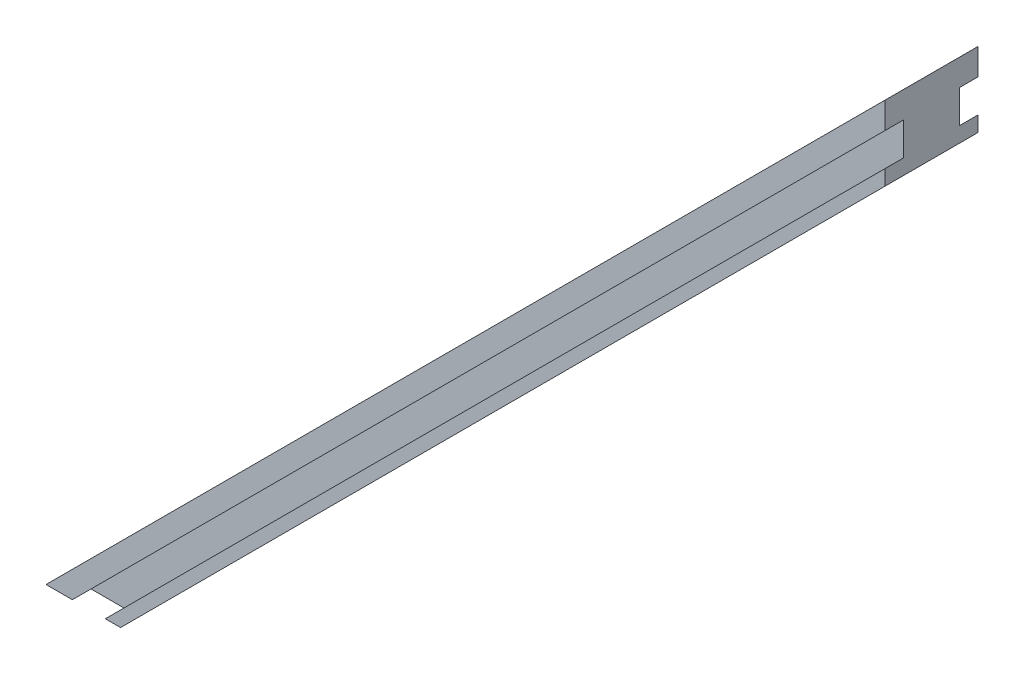
ISO-10303-21;
HEADER;
FILE_DESCRIPTION(('STEP AP214'),'2;1');
FILE_NAME('part.step','',(''),(''),'','','');
FILE_SCHEMA(('AUTOMOTIVE_DESIGN { 1 0 10303 214 1 1 1 1 }'));
ENDSEC;
DATA;
#1=APPLICATION_CONTEXT('core data for automotive mechanical design processes');
#2=APPLICATION_PROTOCOL_DEFINITION('international standard','automotive_design',2000,#1);
#3=PRODUCT_CONTEXT('',#1,'mechanical');
#4=PRODUCT('Part','Part','',(#3));
#5=PRODUCT_RELATED_PRODUCT_CATEGORY('part','',(#4));
#6=PRODUCT_DEFINITION_FORMATION('','',#4);
#7=PRODUCT_DEFINITION_CONTEXT('part definition',#1,'design');
#8=PRODUCT_DEFINITION('design','',#6,#7);
#9=PRODUCT_DEFINITION_SHAPE('','',#8);
#10=(LENGTH_UNIT() NAMED_UNIT(*) SI_UNIT(.MILLI.,.METRE.));
#11=(NAMED_UNIT(*) PLANE_ANGLE_UNIT() SI_UNIT($,.RADIAN.));
#12=(NAMED_UNIT(*) SI_UNIT($,.STERADIAN.) SOLID_ANGLE_UNIT());
#13=UNCERTAINTY_MEASURE_WITH_UNIT(LENGTH_MEASURE(1.E-05),#10,'distance_accuracy_value','');
#14=(GEOMETRIC_REPRESENTATION_CONTEXT(3) GLOBAL_UNCERTAINTY_ASSIGNED_CONTEXT((#13)) GLOBAL_UNIT_ASSIGNED_CONTEXT((#10,
#11,#12)) REPRESENTATION_CONTEXT('',''));
#15=CARTESIAN_POINT('',(0.,0.,0.));
#16=DIRECTION('',(0.,0.,1.));
#17=DIRECTION('',(1.,0.,0.));
#18=AXIS2_PLACEMENT_3D('',#15,#16,#17);
#19=CARTESIAN_POINT('',(-27.8198051533946,-28.7487373415292,0.));
#20=DIRECTION('',(0.707106781186549,-0.707106781186546,0.));
#21=DIRECTION('',(0.707106781186546,0.707106781186549,0.));
#22=AXIS2_PLACEMENT_3D('',#19,#20,#21);
#23=CYLINDRICAL_SURFACE('',#22,1.25);
#24=CARTESIAN_POINT('',(-24.2842712474618,-32.2842712474619,0.));
#25=DIRECTION('',(-0.707106781186549,0.707106781186546,0.));
#26=DIRECTION('',(-0.707106781186546,-0.707106781186549,0.));
#27=AXIS2_PLACEMENT_3D('',#24,#25,#26);
#28=CIRCLE('',#27,1.25);
#29=CARTESIAN_POINT('',(-25.168154723945,-33.1681547239451,0.));
#30=VERTEX_POINT('',#29);
#31=EDGE_CURVE('E269',#30,#30,#28,.T.);
#32=ORIENTED_EDGE('',*,*,#31,.F.);
#33=EDGE_LOOP('',(#32));
#34=FACE_BOUND('',#33,.T.);
#35=CARTESIAN_POINT('',(-27.223611075682,-29.3449314192418,0.));
#36=DIRECTION('',(-0.707106781186549,0.707106781186546,0.));
#37=DIRECTION('',(-0.707106781186546,-0.707106781186549,0.));
#38=AXIS2_PLACEMENT_3D('',#35,#36,#37);
#39=CIRCLE('',#38,1.25);
#40=CARTESIAN_POINT('',(-28.1074945521652,-30.228814895725,0.));
#41=VERTEX_POINT('',#40);
#42=EDGE_CURVE('E38',#41,#41,#39,.T.);
#43=ORIENTED_EDGE('',*,*,#42,.T.);
#44=EDGE_LOOP('',(#43));
#45=FACE_BOUND('',#44,.T.);
#46=ADVANCED_FACE('F34',(#34,#45),#23,.F.);
#47=CARTESIAN_POINT('',(28.7487373415291,27.8198051533947,0.));
#48=DIRECTION('',(0.707106781186549,-0.707106781186546,0.));
#49=DIRECTION('',(0.707106781186546,0.707106781186549,0.));
#50=AXIS2_PLACEMENT_3D('',#47,#48,#49);
#51=CYLINDRICAL_SURFACE('',#50,1.25);
#52=CARTESIAN_POINT('',(32.2842712474618,24.284271247462,0.));
#53=DIRECTION('',(-0.707106781186549,0.707106781186546,0.));
#54=DIRECTION('',(-0.707106781186546,-0.707106781186549,0.));
#55=AXIS2_PLACEMENT_3D('',#52,#53,#54);
#56=CIRCLE('',#55,1.25);
#57=CARTESIAN_POINT('',(31.4003877709786,23.4003877709788,0.));
#58=VERTEX_POINT('',#57);
#59=EDGE_CURVE('E229',#58,#58,#56,.T.);
#60=ORIENTED_EDGE('',*,*,#59,.F.);
#61=EDGE_LOOP('',(#60));
#62=FACE_BOUND('',#61,.T.);
#63=CARTESIAN_POINT('',(29.3449314192417,27.2236110756822,0.));
#64=DIRECTION('',(-0.707106781186549,0.707106781186546,0.));
#65=DIRECTION('',(-0.707106781186546,-0.707106781186549,0.));
#66=AXIS2_PLACEMENT_3D('',#63,#64,#65);
#67=CIRCLE('',#66,1.25);
#68=CARTESIAN_POINT('',(28.4610479427585,26.339727599199,0.));
#69=VERTEX_POINT('',#68);
#70=EDGE_CURVE('E206',#69,#69,#67,.T.);
#71=ORIENTED_EDGE('',*,*,#70,.T.);
#72=EDGE_LOOP('',(#71));
#73=FACE_BOUND('',#72,.T.);
#74=ADVANCED_FACE('F337',(#62,#73),#51,.F.);
#75=CARTESIAN_POINT('',(-44.9999999999998,-45.,5.));
#76=DIRECTION('',(0.,1.,0.));
#77=DIRECTION('',(0.,0.,1.));
#78=AXIS2_PLACEMENT_3D('',#75,#76,#77);
#79=PLANE('',#78);
#80=DIRECTION('',(0.,0.,-1.));
#81=VECTOR('',#80,1.);
#82=CARTESIAN_POINT('',(-42.171572875254,-45.,-3.));
#83=LINE('',#82,#81);
#84=CARTESIAN_POINT('',(-42.171572875254,-45.,-3.));
#85=VERTEX_POINT('',#84);
#86=CARTESIAN_POINT('',(-42.171572875254,-45.,-5.));
#87=VERTEX_POINT('',#86);
#88=EDGE_CURVE('E148',#85,#87,#83,.T.);
#89=ORIENTED_EDGE('',*,*,#88,.F.);
#90=DIRECTION('',(1.,0.,0.));
#91=VECTOR('',#90,1.);
#92=CARTESIAN_POINT('',(-42.171572875254,-45.,-3.));
#93=LINE('',#92,#91);
#94=CARTESIAN_POINT('',(-38.6360389693213,-45.,-3.));
#95=VERTEX_POINT('',#94);
#96=EDGE_CURVE('E131',#85,#95,#93,.T.);
#97=ORIENTED_EDGE('',*,*,#96,.T.);
#98=DIRECTION('',(0.,0.,-1.));
#99=VECTOR('',#98,1.);
#100=CARTESIAN_POINT('',(-38.6360389693213,-45.,-3.));
#101=LINE('',#100,#99);
#102=CARTESIAN_POINT('',(-38.6360389693213,-45.,-5.));
#103=VERTEX_POINT('',#102);
#104=EDGE_CURVE('E127',#95,#103,#101,.T.);
#105=ORIENTED_EDGE('',*,*,#104,.T.);
#106=DIRECTION('',(1.,0.,0.));
#107=VECTOR('',#106,1.);
#108=CARTESIAN_POINT('',(-44.9999999999998,-45.,-5.));
#109=LINE('',#108,#107);
#110=CARTESIAN_POINT('',(-36.9999999999998,-45.,-5.));
#111=VERTEX_POINT('',#110);
#112=EDGE_CURVE('E172',#103,#111,#109,.T.);
#113=ORIENTED_EDGE('',*,*,#112,.T.);
#114=DIRECTION('',(0.,0.,-1.));
#115=VECTOR('',#114,1.);
#116=CARTESIAN_POINT('',(-36.9999999999998,-45.,5.));
#117=LINE('',#116,#115);
#118=CARTESIAN_POINT('',(-36.9999999999998,-45.,5.));
#119=VERTEX_POINT('',#118);
#120=EDGE_CURVE('E11',#119,#111,#117,.T.);
#121=ORIENTED_EDGE('',*,*,#120,.F.);
#122=DIRECTION('',(1.,0.,0.));
#123=VECTOR('',#122,1.);
#124=CARTESIAN_POINT('',(-44.9999999999998,-45.,5.));
#125=LINE('',#124,#123);
#126=CARTESIAN_POINT('',(-38.6360389693213,-45.,5.));
#127=VERTEX_POINT('',#126);
#128=EDGE_CURVE('E183',#127,#119,#125,.T.);
#129=ORIENTED_EDGE('',*,*,#128,.F.);
#130=DIRECTION('',(0.,0.,1.));
#131=VECTOR('',#130,1.);
#132=CARTESIAN_POINT('',(-38.6360389693213,-45.,3.));
#133=LINE('',#132,#131);
#134=CARTESIAN_POINT('',(-38.6360389693213,-45.,3.));
#135=VERTEX_POINT('',#134);
#136=EDGE_CURVE('E173',#135,#127,#133,.T.);
#137=ORIENTED_EDGE('',*,*,#136,.F.);
#138=DIRECTION('',(1.,0.,0.));
#139=VECTOR('',#138,1.);
#140=CARTESIAN_POINT('',(-42.171572875254,-45.,3.));
#141=LINE('',#140,#139);
#142=CARTESIAN_POINT('',(-42.171572875254,-45.,3.));
#143=VERTEX_POINT('',#142);
#144=EDGE_CURVE('E160',#143,#135,#141,.T.);
#145=ORIENTED_EDGE('',*,*,#144,.F.);
#146=DIRECTION('',(0.,0.,1.));
#147=VECTOR('',#146,1.);
#148=CARTESIAN_POINT('',(-42.171572875254,-45.,3.));
#149=LINE('',#148,#147);
#150=CARTESIAN_POINT('',(-42.171572875254,-45.,5.));
#151=VERTEX_POINT('',#150);
#152=EDGE_CURVE('E175',#143,#151,#149,.T.);
#153=ORIENTED_EDGE('',*,*,#152,.T.);
#154=CARTESIAN_POINT('',(-44.9999999999998,-45.,5.));
#155=VERTEX_POINT('',#154);
#156=EDGE_CURVE('E179',#155,#151,#125,.T.);
#157=ORIENTED_EDGE('',*,*,#156,.F.);
#158=DIRECTION('',(0.,0.,-1.));
#159=VECTOR('',#158,1.);
#160=CARTESIAN_POINT('',(-44.9999999999998,-45.,5.));
#161=LINE('',#160,#159);
#162=CARTESIAN_POINT('',(-44.9999999999998,-45.,-5.));
#163=VERTEX_POINT('',#162);
#164=EDGE_CURVE('E191',#155,#163,#161,.T.);
#165=ORIENTED_EDGE('',*,*,#164,.T.);
#166=EDGE_CURVE('E192',#163,#87,#109,.T.);
#167=ORIENTED_EDGE('',*,*,#166,.T.);
#168=EDGE_LOOP('',(#89,#97,#105,#113,#121,#129,#137,#145,#153,#157,#165,#167));
#169=FACE_BOUND('',#168,.T.);
#170=ADVANCED_FACE('F36',(#169),#79,.F.);
#171=CARTESIAN_POINT('',(44.9999999999998,45.,5.));
#172=DIRECTION('',(-1.,0.,0.));
#173=DIRECTION('',(0.,0.,1.));
#174=AXIS2_PLACEMENT_3D('',#171,#172,#173);
#175=PLANE('',#174);
#176=DIRECTION('',(0.,0.,-1.));
#177=VECTOR('',#176,1.);
#178=CARTESIAN_POINT('',(44.9999999999998,42.1715728752538,-3.));
#179=LINE('',#178,#177);
#180=CARTESIAN_POINT('',(44.9999999999998,42.1715728752538,-3.));
#181=VERTEX_POINT('',#180);
#182=CARTESIAN_POINT('',(44.9999999999998,42.1715728752538,-5.));
#183=VERTEX_POINT('',#182);
#184=EDGE_CURVE('E167',#181,#183,#179,.T.);
#185=ORIENTED_EDGE('',*,*,#184,.T.);
#186=DIRECTION('',(0.,1.,0.));
#187=VECTOR('',#186,1.);
#188=CARTESIAN_POINT('',(44.9999999999998,45.,-5.));
#189=LINE('',#188,#187);
#190=CARTESIAN_POINT('',(44.9999999999998,45.,-5.));
#191=VERTEX_POINT('',#190);
#192=EDGE_CURVE('E197',#183,#191,#189,.T.);
#193=ORIENTED_EDGE('',*,*,#192,.T.);
#194=DIRECTION('',(0.,0.,-1.));
#195=VECTOR('',#194,1.);
#196=CARTESIAN_POINT('',(44.9999999999998,45.,5.));
#197=LINE('',#196,#195);
#198=CARTESIAN_POINT('',(44.9999999999998,45.,5.));
#199=VERTEX_POINT('',#198);
#200=EDGE_CURVE('E203',#199,#191,#197,.T.);
#201=ORIENTED_EDGE('',*,*,#200,.F.);
#202=DIRECTION('',(0.,1.,0.));
#203=VECTOR('',#202,1.);
#204=CARTESIAN_POINT('',(44.9999999999998,45.,5.));
#205=LINE('',#204,#203);
#206=CARTESIAN_POINT('',(44.9999999999998,42.1715728752538,5.));
#207=VERTEX_POINT('',#206);
#208=EDGE_CURVE('E185',#207,#199,#205,.T.);
#209=ORIENTED_EDGE('',*,*,#208,.F.);
#210=DIRECTION('',(0.,0.,1.));
#211=VECTOR('',#210,1.);
#212=CARTESIAN_POINT('',(44.9999999999998,42.1715728752538,3.));
#213=LINE('',#212,#211);
#214=CARTESIAN_POINT('',(44.9999999999998,42.1715728752538,3.));
#215=VERTEX_POINT('',#214);
#216=EDGE_CURVE('E59',#215,#207,#213,.T.);
#217=ORIENTED_EDGE('',*,*,#216,.F.);
#218=DIRECTION('',(0.,1.,0.));
#219=VECTOR('',#218,1.);
#220=CARTESIAN_POINT('',(44.9999999999998,38.6360389693211,3.));
#221=LINE('',#220,#219);
#222=CARTESIAN_POINT('',(44.9999999999998,38.6360389693211,3.));
#223=VERTEX_POINT('',#222);
#224=EDGE_CURVE('E153',#223,#215,#221,.T.);
#225=ORIENTED_EDGE('',*,*,#224,.F.);
#226=DIRECTION('',(0.,0.,1.));
#227=VECTOR('',#226,1.);
#228=CARTESIAN_POINT('',(44.9999999999998,38.6360389693211,3.));
#229=LINE('',#228,#227);
#230=CARTESIAN_POINT('',(44.9999999999998,38.6360389693211,5.));
#231=VERTEX_POINT('',#230);
#232=EDGE_CURVE('E169',#223,#231,#229,.T.);
#233=ORIENTED_EDGE('',*,*,#232,.T.);
#234=CARTESIAN_POINT('',(44.9999999999998,37.,5.));
#235=VERTEX_POINT('',#234);
#236=EDGE_CURVE('E186',#235,#231,#205,.T.);
#237=ORIENTED_EDGE('',*,*,#236,.F.);
#238=DIRECTION('',(0.,0.,-1.));
#239=VECTOR('',#238,1.);
#240=CARTESIAN_POINT('',(44.9999999999998,37.,5.));
#241=LINE('',#240,#239);
#242=CARTESIAN_POINT('',(44.9999999999998,37.,-5.));
#243=VERTEX_POINT('',#242);
#244=EDGE_CURVE('E43',#235,#243,#241,.T.);
#245=ORIENTED_EDGE('',*,*,#244,.T.);
#246=CARTESIAN_POINT('',(44.9999999999998,38.6360389693211,-5.));
#247=VERTEX_POINT('',#246);
#248=EDGE_CURVE('E146',#243,#247,#189,.T.);
#249=ORIENTED_EDGE('',*,*,#248,.T.);
#250=DIRECTION('',(0.,0.,-1.));
#251=VECTOR('',#250,1.);
#252=CARTESIAN_POINT('',(44.9999999999998,38.6360389693211,-3.));
#253=LINE('',#252,#251);
#254=CARTESIAN_POINT('',(44.9999999999998,38.6360389693211,-3.));
#255=VERTEX_POINT('',#254);
#256=EDGE_CURVE('E51',#255,#247,#253,.T.);
#257=ORIENTED_EDGE('',*,*,#256,.F.);
#258=DIRECTION('',(0.,1.,0.));
#259=VECTOR('',#258,1.);
#260=CARTESIAN_POINT('',(44.9999999999998,38.6360389693211,-3.));
#261=LINE('',#260,#259);
#262=EDGE_CURVE('E132',#255,#181,#261,.T.);
#263=ORIENTED_EDGE('',*,*,#262,.T.);
#264=EDGE_LOOP('',(#185,#193,#201,#209,#217,#225,#233,#237,#245,#249,#257,#263));
#265=FACE_BOUND('',#264,.T.);
#266=ADVANCED_FACE('F143',(#265),#175,.F.);
#267=CARTESIAN_POINT('',(0.,0.,-5.));
#268=DIRECTION('',(0.,0.,-1.));
#269=DIRECTION('',(-1.,0.,0.));
#270=AXIS2_PLACEMENT_3D('',#267,#268,#269);
#271=PLANE('',#270);
#272=ORIENTED_EDGE('',*,*,#192,.F.);
#273=DIRECTION('',(-0.707106781186547,-0.707106781186547,0.));
#274=VECTOR('',#273,1.);
#275=CARTESIAN_POINT('',(44.9999999999998,42.1715728752538,-5.));
#276=LINE('',#275,#274);
#277=EDGE_CURVE('E140',#183,#87,#276,.T.);
#278=ORIENTED_EDGE('',*,*,#277,.T.);
#279=ORIENTED_EDGE('',*,*,#166,.F.);
#280=DIRECTION('',(-0.707106781186546,-0.707106781186549,0.));
#281=VECTOR('',#280,1.);
#282=CARTESIAN_POINT('',(-44.9999999999998,-45.,-5.));
#283=LINE('',#282,#281);
#284=EDGE_CURVE('E199',#191,#163,#283,.T.);
#285=ORIENTED_EDGE('',*,*,#284,.F.);
#286=EDGE_LOOP('',(#272,#278,#279,#285));
#287=FACE_BOUND('',#286,.T.);
#288=ADVANCED_FACE('F294',(#287),#271,.T.);
#289=ORIENTED_EDGE('',*,*,#112,.F.);
#290=DIRECTION('',(0.707106781186547,0.707106781186548,0.));
#291=VECTOR('',#290,1.);
#292=CARTESIAN_POINT('',(-38.6360389693213,-45.,-5.));
#293=LINE('',#292,#291);
#294=EDGE_CURVE('E280',#103,#247,#293,.T.);
#295=ORIENTED_EDGE('',*,*,#294,.T.);
#296=ORIENTED_EDGE('',*,*,#248,.F.);
#297=DIRECTION('',(0.707106781186546,0.707106781186549,0.));
#298=VECTOR('',#297,1.);
#299=CARTESIAN_POINT('',(-36.9999999999998,-45.,-5.));
#300=LINE('',#299,#298);
#301=EDGE_CURVE('E195',#111,#243,#300,.T.);
#302=ORIENTED_EDGE('',*,*,#301,.F.);
#303=EDGE_LOOP('',(#289,#295,#296,#302));
#304=FACE_BOUND('',#303,.T.);
#305=ADVANCED_FACE('F327',(#304),#271,.T.);
#306=CARTESIAN_POINT('',(0.,0.,5.));
#307=DIRECTION('',(0.,0.,-1.));
#308=DIRECTION('',(-1.,0.,0.));
#309=AXIS2_PLACEMENT_3D('',#306,#307,#308);
#310=PLANE('',#309);
#311=ORIENTED_EDGE('',*,*,#236,.T.);
#312=DIRECTION('',(0.707106781186547,0.707106781186548,0.));
#313=VECTOR('',#312,1.);
#314=CARTESIAN_POINT('',(-38.6360389693213,-45.,5.));
#315=LINE('',#314,#313);
#316=EDGE_CURVE('E157',#127,#231,#315,.T.);
#317=ORIENTED_EDGE('',*,*,#316,.F.);
#318=ORIENTED_EDGE('',*,*,#128,.T.);
#319=DIRECTION('',(0.707106781186546,0.707106781186549,0.));
#320=VECTOR('',#319,1.);
#321=CARTESIAN_POINT('',(-36.9999999999998,-45.,5.));
#322=LINE('',#321,#320);
#323=EDGE_CURVE('E182',#119,#235,#322,.T.);
#324=ORIENTED_EDGE('',*,*,#323,.T.);
#325=EDGE_LOOP('',(#311,#317,#318,#324));
#326=FACE_BOUND('',#325,.T.);
#327=ADVANCED_FACE('F318',(#326),#310,.F.);
#328=CARTESIAN_POINT('',(-36.9999999999998,-45.,5.));
#329=DIRECTION('',(-0.707106781186549,0.707106781186546,0.));
#330=DIRECTION('',(-0.707106781186546,-0.707106781186549,0.));
#331=AXIS2_PLACEMENT_3D('',#328,#329,#330);
#332=PLANE('',#331);
#333=CARTESIAN_POINT('',(25.2132034355964,17.2132034355965,0.));
#334=DIRECTION('',(-0.707106781186549,0.707106781186546,0.));
#335=DIRECTION('',(-0.707106781186546,-0.707106781186549,0.));
#336=AXIS2_PLACEMENT_3D('',#333,#334,#335);
#337=CIRCLE('',#336,1.25);
#338=CARTESIAN_POINT('',(24.3293199591132,16.3293199591133,0.));
#339=VERTEX_POINT('',#338);
#340=EDGE_CURVE('E230',#339,#339,#337,.T.);
#341=ORIENTED_EDGE('',*,*,#340,.T.);
#342=EDGE_LOOP('',(#341));
#343=FACE_BOUND('',#342,.T.);
#344=CARTESIAN_POINT('',(18.1421356237309,10.142135623731,0.));
#345=DIRECTION('',(-0.707106781186549,0.707106781186546,0.));
#346=DIRECTION('',(-0.707106781186546,-0.707106781186549,0.));
#347=AXIS2_PLACEMENT_3D('',#344,#345,#346);
#348=CIRCLE('',#347,1.25);
#349=CARTESIAN_POINT('',(17.2582521472477,9.25825214724783,0.));
#350=VERTEX_POINT('',#349);
#351=EDGE_CURVE('E236',#350,#350,#348,.T.);
#352=ORIENTED_EDGE('',*,*,#351,.T.);
#353=EDGE_LOOP('',(#352));
#354=FACE_BOUND('',#353,.T.);
#355=CARTESIAN_POINT('',(11.0710678118654,3.07106781186552,0.));
#356=DIRECTION('',(-0.707106781186549,0.707106781186546,0.));
#357=DIRECTION('',(-0.707106781186546,-0.707106781186549,0.));
#358=AXIS2_PLACEMENT_3D('',#355,#356,#357);
#359=CIRCLE('',#358,1.25);
#360=CARTESIAN_POINT('',(10.1871843353823,2.18718433538233,0.));
#361=VERTEX_POINT('',#360);
#362=EDGE_CURVE('E242',#361,#361,#359,.T.);
#363=ORIENTED_EDGE('',*,*,#362,.T.);
#364=EDGE_LOOP('',(#363));
#365=FACE_BOUND('',#364,.T.);
#366=CARTESIAN_POINT('',(3.99999999999998,-3.99999999999997,0.));
#367=DIRECTION('',(-0.707106781186549,0.707106781186546,0.));
#368=DIRECTION('',(-0.707106781186546,-0.707106781186549,0.));
#369=AXIS2_PLACEMENT_3D('',#366,#367,#368);
#370=CIRCLE('',#369,1.25);
#371=CARTESIAN_POINT('',(3.1161165235168,-4.88388347648316,0.));
#372=VERTEX_POINT('',#371);
#373=EDGE_CURVE('E248',#372,#372,#370,.T.);
#374=ORIENTED_EDGE('',*,*,#373,.T.);
#375=EDGE_LOOP('',(#374));
#376=FACE_BOUND('',#375,.T.);
#377=CARTESIAN_POINT('',(-3.07106781186547,-11.0710678118655,0.));
#378=DIRECTION('',(-0.707106781186549,0.707106781186546,0.));
#379=DIRECTION('',(-0.707106781186546,-0.707106781186549,0.));
#380=AXIS2_PLACEMENT_3D('',#377,#378,#379);
#381=CIRCLE('',#380,1.25);
#382=CARTESIAN_POINT('',(-3.95495128834865,-11.9549512883487,0.));
#383=VERTEX_POINT('',#382);
#384=EDGE_CURVE('E254',#383,#383,#381,.T.);
#385=ORIENTED_EDGE('',*,*,#384,.T.);
#386=EDGE_LOOP('',(#385));
#387=FACE_BOUND('',#386,.T.);
#388=CARTESIAN_POINT('',(-10.1421356237309,-18.142135623731,0.));
#389=DIRECTION('',(-0.707106781186549,0.707106781186546,0.));
#390=DIRECTION('',(-0.707106781186546,-0.707106781186549,0.));
#391=AXIS2_PLACEMENT_3D('',#388,#389,#390);
#392=CIRCLE('',#391,1.25);
#393=CARTESIAN_POINT('',(-11.0260191002141,-19.0260191002141,0.));
#394=VERTEX_POINT('',#393);
#395=EDGE_CURVE('E260',#394,#394,#392,.T.);
#396=ORIENTED_EDGE('',*,*,#395,.T.);
#397=EDGE_LOOP('',(#396));
#398=FACE_BOUND('',#397,.T.);
#399=CARTESIAN_POINT('',(-17.2132034355964,-25.2132034355965,0.));
#400=DIRECTION('',(-0.707106781186549,0.707106781186546,0.));
#401=DIRECTION('',(-0.707106781186546,-0.707106781186549,0.));
#402=AXIS2_PLACEMENT_3D('',#399,#400,#401);
#403=CIRCLE('',#402,1.25);
#404=CARTESIAN_POINT('',(-18.0970869120796,-26.0970869120796,0.));
#405=VERTEX_POINT('',#404);
#406=EDGE_CURVE('E266',#405,#405,#403,.T.);
#407=ORIENTED_EDGE('',*,*,#406,.T.);
#408=EDGE_LOOP('',(#407));
#409=FACE_BOUND('',#408,.T.);
#410=ORIENTED_EDGE('',*,*,#31,.T.);
#411=EDGE_LOOP('',(#410));
#412=FACE_BOUND('',#411,.T.);
#413=CARTESIAN_POINT('',(-31.3553390593273,-39.3553390593274,0.));
#414=DIRECTION('',(-0.707106781186549,0.707106781186546,0.));
#415=DIRECTION('',(-0.707106781186546,-0.707106781186549,0.));
#416=AXIS2_PLACEMENT_3D('',#413,#414,#415);
#417=CIRCLE('',#416,1.25);
#418=CARTESIAN_POINT('',(-32.2392225358105,-40.2392225358106,0.));
#419=VERTEX_POINT('',#418);
#420=EDGE_CURVE('E208',#419,#419,#417,.T.);
#421=ORIENTED_EDGE('',*,*,#420,.T.);
#422=EDGE_LOOP('',(#421));
#423=FACE_BOUND('',#422,.T.);
#424=ORIENTED_EDGE('',*,*,#59,.T.);
#425=EDGE_LOOP('',(#424));
#426=FACE_BOUND('',#425,.T.);
#427=CARTESIAN_POINT('',(39.3553390593273,31.3553390593275,0.));
#428=DIRECTION('',(-0.707106781186549,0.707106781186546,0.));
#429=DIRECTION('',(-0.707106781186546,-0.707106781186549,0.));
#430=AXIS2_PLACEMENT_3D('',#427,#428,#429);
#431=CIRCLE('',#430,1.25);
#432=CARTESIAN_POINT('',(38.4714555828441,30.4714555828443,0.));
#433=VERTEX_POINT('',#432);
#434=EDGE_CURVE('E276',#433,#433,#431,.T.);
#435=ORIENTED_EDGE('',*,*,#434,.T.);
#436=EDGE_LOOP('',(#435));
#437=FACE_BOUND('',#436,.T.);
#438=ORIENTED_EDGE('',*,*,#301,.T.);
#439=ORIENTED_EDGE('',*,*,#244,.F.);
#440=ORIENTED_EDGE('',*,*,#323,.F.);
#441=ORIENTED_EDGE('',*,*,#120,.T.);
#442=EDGE_LOOP('',(#438,#439,#440,#441));
#443=FACE_BOUND('',#442,.T.);
#444=ADVANCED_FACE('F323',(#343,#354,#365,#376,#387,#398,#409,#412,#423,#426,#437,#443),#332,.F.);
#445=CARTESIAN_POINT('',(-44.9999999999998,-45.,5.));
#446=DIRECTION('',(0.707106781186549,-0.707106781186546,0.));
#447=DIRECTION('',(0.707106781186546,0.707106781186549,0.));
#448=AXIS2_PLACEMENT_3D('',#445,#446,#447);
#449=PLANE('',#448);
#450=CARTESIAN_POINT('',(-28.2842712474618,-28.284271247462,0.));
#451=DIRECTION('',(-0.707106781186549,0.707106781186546,0.));
#452=DIRECTION('',(-0.707106781186546,-0.707106781186549,0.));
#453=AXIS2_PLACEMENT_3D('',#450,#451,#452);
#454=CIRCLE('',#453,3.5);
#455=CARTESIAN_POINT('',(-30.7591449816147,-30.7591449816149,0.));
#456=VERTEX_POINT('',#455);
#457=EDGE_CURVE('E223',#456,#456,#454,.T.);
#458=ORIENTED_EDGE('',*,*,#457,.F.);
#459=EDGE_LOOP('',(#458));
#460=FACE_BOUND('',#459,.T.);
#461=CARTESIAN_POINT('',(28.2842712474618,28.284271247462,0.));
#462=DIRECTION('',(-0.707106781186549,0.707106781186546,0.));
#463=DIRECTION('',(-0.707106781186546,-0.707106781186549,0.));
#464=AXIS2_PLACEMENT_3D('',#461,#462,#463);
#465=CIRCLE('',#464,3.5);
#466=CARTESIAN_POINT('',(25.8093975133089,25.8093975133091,0.));
#467=VERTEX_POINT('',#466);
#468=EDGE_CURVE('E216',#467,#467,#465,.T.);
#469=ORIENTED_EDGE('',*,*,#468,.F.);
#470=EDGE_LOOP('',(#469));
#471=FACE_BOUND('',#470,.T.);
#472=ORIENTED_EDGE('',*,*,#284,.T.);
#473=ORIENTED_EDGE('',*,*,#164,.F.);
#474=DIRECTION('',(-0.707106781186546,-0.707106781186549,0.));
#475=VECTOR('',#474,1.);
#476=CARTESIAN_POINT('',(-44.9999999999998,-45.,5.));
#477=LINE('',#476,#475);
#478=EDGE_CURVE('E189',#199,#155,#477,.T.);
#479=ORIENTED_EDGE('',*,*,#478,.F.);
#480=ORIENTED_EDGE('',*,*,#200,.T.);
#481=EDGE_LOOP('',(#472,#473,#479,#480));
#482=FACE_BOUND('',#481,.T.);
#483=ADVANCED_FACE('F300',(#460,#471,#482),#449,.F.);
#484=ORIENTED_EDGE('',*,*,#156,.T.);
#485=DIRECTION('',(-0.707106781186547,-0.707106781186547,0.));
#486=VECTOR('',#485,1.);
#487=CARTESIAN_POINT('',(44.9999999999998,42.1715728752538,5.));
#488=LINE('',#487,#486);
#489=EDGE_CURVE('E165',#207,#151,#488,.T.);
#490=ORIENTED_EDGE('',*,*,#489,.F.);
#491=ORIENTED_EDGE('',*,*,#208,.T.);
#492=ORIENTED_EDGE('',*,*,#478,.T.);
#493=EDGE_LOOP('',(#484,#490,#491,#492));
#494=FACE_BOUND('',#493,.T.);
#495=ADVANCED_FACE('F305',(#494),#310,.F.);
#496=CARTESIAN_POINT('',(-38.6360389693213,-45.,3.));
#497=DIRECTION('',(0.707106781186548,-0.707106781186547,0.));
#498=DIRECTION('',(0.707106781186547,0.707106781186548,0.));
#499=AXIS2_PLACEMENT_3D('',#496,#497,#498);
#500=PLANE('',#499);
#501=ORIENTED_EDGE('',*,*,#316,.T.);
#502=ORIENTED_EDGE('',*,*,#232,.F.);
#503=DIRECTION('',(0.707106781186547,0.707106781186548,0.));
#504=VECTOR('',#503,1.);
#505=CARTESIAN_POINT('',(-38.6360389693213,-45.,3.));
#506=LINE('',#505,#504);
#507=EDGE_CURVE('E162',#135,#223,#506,.T.);
#508=ORIENTED_EDGE('',*,*,#507,.F.);
#509=ORIENTED_EDGE('',*,*,#136,.T.);
#510=EDGE_LOOP('',(#501,#502,#508,#509));
#511=FACE_BOUND('',#510,.T.);
#512=ADVANCED_FACE('F314',(#511),#500,.F.);
#513=CARTESIAN_POINT('',(44.9999999999998,42.1715728752538,3.));
#514=DIRECTION('',(-0.707106781186548,0.707106781186548,0.));
#515=DIRECTION('',(-0.707106781186547,-0.707106781186548,0.));
#516=AXIS2_PLACEMENT_3D('',#513,#514,#515);
#517=PLANE('',#516);
#518=ORIENTED_EDGE('',*,*,#489,.T.);
#519=ORIENTED_EDGE('',*,*,#152,.F.);
#520=DIRECTION('',(-0.707106781186547,-0.707106781186547,0.));
#521=VECTOR('',#520,1.);
#522=CARTESIAN_POINT('',(44.9999999999998,42.1715728752538,3.));
#523=LINE('',#522,#521);
#524=EDGE_CURVE('E156',#215,#143,#523,.T.);
#525=ORIENTED_EDGE('',*,*,#524,.F.);
#526=ORIENTED_EDGE('',*,*,#216,.T.);
#527=EDGE_LOOP('',(#518,#519,#525,#526));
#528=FACE_BOUND('',#527,.T.);
#529=ADVANCED_FACE('F306',(#528),#517,.F.);
#530=CARTESIAN_POINT('',(0.,0.,3.));
#531=DIRECTION('',(0.,0.,-1.));
#532=DIRECTION('',(-1.,0.,0.));
#533=AXIS2_PLACEMENT_3D('',#530,#531,#532);
#534=PLANE('',#533);
#535=ORIENTED_EDGE('',*,*,#224,.T.);
#536=ORIENTED_EDGE('',*,*,#524,.T.);
#537=ORIENTED_EDGE('',*,*,#144,.T.);
#538=ORIENTED_EDGE('',*,*,#507,.T.);
#539=EDGE_LOOP('',(#535,#536,#537,#538));
#540=FACE_BOUND('',#539,.T.);
#541=ADVANCED_FACE('F312',(#540),#534,.F.);
#542=CARTESIAN_POINT('',(44.9999999999998,42.1715728752538,-3.));
#543=DIRECTION('',(0.707106781186548,-0.707106781186548,0.));
#544=DIRECTION('',(0.707106781186547,0.707106781186548,0.));
#545=AXIS2_PLACEMENT_3D('',#542,#543,#544);
#546=PLANE('',#545);
#547=ORIENTED_EDGE('',*,*,#277,.F.);
#548=ORIENTED_EDGE('',*,*,#184,.F.);
#549=DIRECTION('',(-0.707106781186547,-0.707106781186547,0.));
#550=VECTOR('',#549,1.);
#551=CARTESIAN_POINT('',(44.9999999999998,42.1715728752538,-3.));
#552=LINE('',#551,#550);
#553=EDGE_CURVE('E136',#181,#85,#552,.T.);
#554=ORIENTED_EDGE('',*,*,#553,.T.);
#555=ORIENTED_EDGE('',*,*,#88,.T.);
#556=EDGE_LOOP('',(#547,#548,#554,#555));
#557=FACE_BOUND('',#556,.T.);
#558=ADVANCED_FACE('F289',(#557),#546,.T.);
#559=CARTESIAN_POINT('',(-38.6360389693213,-45.,-3.));
#560=DIRECTION('',(-0.707106781186548,0.707106781186547,0.));
#561=DIRECTION('',(-0.707106781186547,-0.707106781186548,0.));
#562=AXIS2_PLACEMENT_3D('',#559,#560,#561);
#563=PLANE('',#562);
#564=ORIENTED_EDGE('',*,*,#294,.F.);
#565=ORIENTED_EDGE('',*,*,#104,.F.);
#566=DIRECTION('',(0.707106781186547,0.707106781186548,0.));
#567=VECTOR('',#566,1.);
#568=CARTESIAN_POINT('',(-38.6360389693213,-45.,-3.));
#569=LINE('',#568,#567);
#570=EDGE_CURVE('E123',#95,#255,#569,.T.);
#571=ORIENTED_EDGE('',*,*,#570,.T.);
#572=ORIENTED_EDGE('',*,*,#256,.T.);
#573=EDGE_LOOP('',(#564,#565,#571,#572));
#574=FACE_BOUND('',#573,.T.);
#575=ADVANCED_FACE('F125',(#574),#563,.T.);
#576=CARTESIAN_POINT('',(0.,0.,-3.));
#577=DIRECTION('',(0.,0.,1.));
#578=DIRECTION('',(-1.,0.,0.));
#579=AXIS2_PLACEMENT_3D('',#576,#577,#578);
#580=PLANE('',#579);
#581=ORIENTED_EDGE('',*,*,#262,.F.);
#582=ORIENTED_EDGE('',*,*,#570,.F.);
#583=ORIENTED_EDGE('',*,*,#96,.F.);
#584=ORIENTED_EDGE('',*,*,#553,.F.);
#585=EDGE_LOOP('',(#581,#582,#583,#584));
#586=FACE_BOUND('',#585,.T.);
#587=ADVANCED_FACE('F135',(#586),#580,.F.);
#588=CARTESIAN_POINT('',(35.8198051533945,34.8908729652602,0.));
#589=DIRECTION('',(0.707106781186549,-0.707106781186546,0.));
#590=DIRECTION('',(0.707106781186546,0.707106781186549,0.));
#591=AXIS2_PLACEMENT_3D('',#588,#589,#590);
#592=CYLINDRICAL_SURFACE('',#591,1.25);
#593=CARTESIAN_POINT('',(35.8198051533945,34.8908729652602,0.));
#594=DIRECTION('',(-0.707106781186549,0.707106781186546,0.));
#595=DIRECTION('',(-0.707106781186546,-0.707106781186549,0.));
#596=AXIS2_PLACEMENT_3D('',#593,#594,#595);
#597=CIRCLE('',#596,1.25);
#598=CARTESIAN_POINT('',(34.9359216769113,34.006989488777,0.));
#599=VERTEX_POINT('',#598);
#600=EDGE_CURVE('E277',#599,#599,#597,.T.);
#601=ORIENTED_EDGE('',*,*,#600,.T.);
#602=EDGE_LOOP('',(#601));
#603=FACE_BOUND('',#602,.T.);
#604=ORIENTED_EDGE('',*,*,#434,.F.);
#605=EDGE_LOOP('',(#604));
#606=FACE_BOUND('',#605,.T.);
#607=ADVANCED_FACE('F362',(#603,#606),#592,.F.);
#608=CARTESIAN_POINT('',(35.8198051533945,34.8908729652602,0.));
#609=DIRECTION('',(-0.707106781186549,0.707106781186546,0.));
#610=DIRECTION('',(-0.707106781186546,-0.707106781186549,0.));
#611=AXIS2_PLACEMENT_3D('',#608,#609,#610);
#612=PLANE('',#611);
#613=ORIENTED_EDGE('',*,*,#600,.F.);
#614=EDGE_LOOP('',(#613));
#615=FACE_BOUND('',#614,.T.);
#616=ADVANCED_FACE('F357',(#615),#612,.F.);
#617=CARTESIAN_POINT('',(-34.8908729652601,-35.8198051533947,0.));
#618=DIRECTION('',(0.707106781186549,-0.707106781186546,0.));
#619=DIRECTION('',(0.707106781186546,0.707106781186549,0.));
#620=AXIS2_PLACEMENT_3D('',#617,#618,#619);
#621=CYLINDRICAL_SURFACE('',#620,1.25);
#622=CARTESIAN_POINT('',(-34.8908729652601,-35.8198051533947,0.));
#623=DIRECTION('',(-0.707106781186549,0.707106781186546,0.));
#624=DIRECTION('',(-0.707106781186546,-0.707106781186549,0.));
#625=AXIS2_PLACEMENT_3D('',#622,#623,#624);
#626=CIRCLE('',#625,1.25);
#627=CARTESIAN_POINT('',(-35.7747564417432,-36.7036886298779,0.));
#628=VERTEX_POINT('',#627);
#629=EDGE_CURVE('E213',#628,#628,#626,.T.);
#630=ORIENTED_EDGE('',*,*,#629,.T.);
#631=EDGE_LOOP('',(#630));
#632=FACE_BOUND('',#631,.T.);
#633=ORIENTED_EDGE('',*,*,#420,.F.);
#634=EDGE_LOOP('',(#633));
#635=FACE_BOUND('',#634,.T.);
#636=ADVANCED_FACE('F354',(#632,#635),#621,.F.);
#637=CARTESIAN_POINT('',(-34.8908729652601,-35.8198051533947,0.));
#638=DIRECTION('',(-0.707106781186549,0.707106781186546,0.));
#639=DIRECTION('',(-0.707106781186546,-0.707106781186549,0.));
#640=AXIS2_PLACEMENT_3D('',#637,#638,#639);
#641=PLANE('',#640);
#642=ORIENTED_EDGE('',*,*,#629,.F.);
#643=EDGE_LOOP('',(#642));
#644=FACE_BOUND('',#643,.T.);
#645=ADVANCED_FACE('F351',(#644),#641,.F.);
#646=CARTESIAN_POINT('',(-20.7487373415291,-21.6776695296637,0.));
#647=DIRECTION('',(0.707106781186549,-0.707106781186546,0.));
#648=DIRECTION('',(0.707106781186546,0.707106781186549,0.));
#649=AXIS2_PLACEMENT_3D('',#646,#647,#648);
#650=CYLINDRICAL_SURFACE('',#649,1.25);
#651=CARTESIAN_POINT('',(-20.7487373415291,-21.6776695296637,0.));
#652=DIRECTION('',(-0.707106781186549,0.707106781186546,0.));
#653=DIRECTION('',(-0.707106781186546,-0.707106781186549,0.));
#654=AXIS2_PLACEMENT_3D('',#651,#652,#653);
#655=CIRCLE('',#654,1.25);
#656=CARTESIAN_POINT('',(-21.6326208180123,-22.5615530061469,0.));
#657=VERTEX_POINT('',#656);
#658=EDGE_CURVE('E263',#657,#657,#655,.T.);
#659=ORIENTED_EDGE('',*,*,#658,.T.);
#660=EDGE_LOOP('',(#659));
#661=FACE_BOUND('',#660,.T.);
#662=ORIENTED_EDGE('',*,*,#406,.F.);
#663=EDGE_LOOP('',(#662));
#664=FACE_BOUND('',#663,.T.);
#665=ADVANCED_FACE('F349',(#661,#664),#650,.F.);
#666=CARTESIAN_POINT('',(-20.7487373415291,-21.6776695296637,0.));
#667=DIRECTION('',(-0.707106781186549,0.707106781186546,0.));
#668=DIRECTION('',(-0.707106781186546,-0.707106781186549,0.));
#669=AXIS2_PLACEMENT_3D('',#666,#667,#668);
#670=PLANE('',#669);
#671=ORIENTED_EDGE('',*,*,#658,.F.);
#672=EDGE_LOOP('',(#671));
#673=FACE_BOUND('',#672,.T.);
#674=ADVANCED_FACE('F504',(#673),#670,.F.);
#675=CARTESIAN_POINT('',(-13.6776695296637,-14.6066017177982,0.));
#676=DIRECTION('',(0.707106781186549,-0.707106781186546,0.));
#677=DIRECTION('',(0.707106781186546,0.707106781186549,0.));
#678=AXIS2_PLACEMENT_3D('',#675,#676,#677);
#679=CYLINDRICAL_SURFACE('',#678,1.25);
#680=CARTESIAN_POINT('',(-13.6776695296637,-14.6066017177982,0.));
#681=DIRECTION('',(-0.707106781186549,0.707106781186546,0.));
#682=DIRECTION('',(-0.707106781186546,-0.707106781186549,0.));
#683=AXIS2_PLACEMENT_3D('',#680,#681,#682);
#684=CIRCLE('',#683,1.25);
#685=CARTESIAN_POINT('',(-14.5615530061469,-15.4904851942814,0.));
#686=VERTEX_POINT('',#685);
#687=EDGE_CURVE('E257',#686,#686,#684,.T.);
#688=ORIENTED_EDGE('',*,*,#687,.T.);
#689=EDGE_LOOP('',(#688));
#690=FACE_BOUND('',#689,.T.);
#691=ORIENTED_EDGE('',*,*,#395,.F.);
#692=EDGE_LOOP('',(#691));
#693=FACE_BOUND('',#692,.T.);
#694=ADVANCED_FACE('F501',(#690,#693),#679,.F.);
#695=CARTESIAN_POINT('',(-13.6776695296637,-14.6066017177982,0.));
#696=DIRECTION('',(-0.707106781186549,0.707106781186546,0.));
#697=DIRECTION('',(-0.707106781186546,-0.707106781186549,0.));
#698=AXIS2_PLACEMENT_3D('',#695,#696,#697);
#699=PLANE('',#698);
#700=ORIENTED_EDGE('',*,*,#687,.F.);
#701=EDGE_LOOP('',(#700));
#702=FACE_BOUND('',#701,.T.);
#703=ADVANCED_FACE('F497',(#702),#699,.F.);
#704=CARTESIAN_POINT('',(-6.60660171779822,-7.53553390593273,0.));
#705=DIRECTION('',(0.707106781186549,-0.707106781186546,0.));
#706=DIRECTION('',(0.707106781186546,0.707106781186549,0.));
#707=AXIS2_PLACEMENT_3D('',#704,#705,#706);
#708=CYLINDRICAL_SURFACE('',#707,1.25);
#709=CARTESIAN_POINT('',(-6.60660171779822,-7.53553390593273,0.));
#710=DIRECTION('',(-0.707106781186549,0.707106781186546,0.));
#711=DIRECTION('',(-0.707106781186546,-0.707106781186549,0.));
#712=AXIS2_PLACEMENT_3D('',#709,#710,#711);
#713=CIRCLE('',#712,1.25);
#714=CARTESIAN_POINT('',(-7.4904851942814,-8.41941738241592,0.));
#715=VERTEX_POINT('',#714);
#716=EDGE_CURVE('E251',#715,#715,#713,.T.);
#717=ORIENTED_EDGE('',*,*,#716,.T.);
#718=EDGE_LOOP('',(#717));
#719=FACE_BOUND('',#718,.T.);
#720=ORIENTED_EDGE('',*,*,#384,.F.);
#721=EDGE_LOOP('',(#720));
#722=FACE_BOUND('',#721,.T.);
#723=ADVANCED_FACE('F493',(#719,#722),#708,.F.);
#724=CARTESIAN_POINT('',(-6.60660171779822,-7.53553390593273,0.));
#725=DIRECTION('',(-0.707106781186549,0.707106781186546,0.));
#726=DIRECTION('',(-0.707106781186546,-0.707106781186549,0.));
#727=AXIS2_PLACEMENT_3D('',#724,#725,#726);
#728=PLANE('',#727);
#729=ORIENTED_EDGE('',*,*,#716,.F.);
#730=EDGE_LOOP('',(#729));
#731=FACE_BOUND('',#730,.T.);
#732=ADVANCED_FACE('F489',(#731),#728,.F.);
#733=CARTESIAN_POINT('',(0.464466094067236,-0.464466094067241,0.));
#734=DIRECTION('',(0.707106781186549,-0.707106781186546,0.));
#735=DIRECTION('',(0.707106781186546,0.707106781186549,0.));
#736=AXIS2_PLACEMENT_3D('',#733,#734,#735);
#737=CYLINDRICAL_SURFACE('',#736,1.25);
#738=CARTESIAN_POINT('',(0.464466094067236,-0.464466094067241,0.));
#739=DIRECTION('',(-0.707106781186549,0.707106781186546,0.));
#740=DIRECTION('',(-0.707106781186546,-0.707106781186549,0.));
#741=AXIS2_PLACEMENT_3D('',#738,#739,#740);
#742=CIRCLE('',#741,1.25);
#743=CARTESIAN_POINT('',(-0.419417382415949,-1.34834957055043,0.));
#744=VERTEX_POINT('',#743);
#745=EDGE_CURVE('E245',#744,#744,#742,.T.);
#746=ORIENTED_EDGE('',*,*,#745,.T.);
#747=EDGE_LOOP('',(#746));
#748=FACE_BOUND('',#747,.T.);
#749=ORIENTED_EDGE('',*,*,#373,.F.);
#750=EDGE_LOOP('',(#749));
#751=FACE_BOUND('',#750,.T.);
#752=ADVANCED_FACE('F485',(#748,#751),#737,.F.);
#753=CARTESIAN_POINT('',(0.464466094067236,-0.464466094067241,0.));
#754=DIRECTION('',(-0.707106781186549,0.707106781186546,0.));
#755=DIRECTION('',(-0.707106781186546,-0.707106781186549,0.));
#756=AXIS2_PLACEMENT_3D('',#753,#754,#755);
#757=PLANE('',#756);
#758=ORIENTED_EDGE('',*,*,#745,.F.);
#759=EDGE_LOOP('',(#758));
#760=FACE_BOUND('',#759,.T.);
#761=ADVANCED_FACE('F481',(#760),#757,.F.);
#762=CARTESIAN_POINT('',(7.5355339059327,6.60660171779825,0.));
#763=DIRECTION('',(0.707106781186549,-0.707106781186546,0.));
#764=DIRECTION('',(0.707106781186546,0.707106781186549,0.));
#765=AXIS2_PLACEMENT_3D('',#762,#763,#764);
#766=CYLINDRICAL_SURFACE('',#765,1.25);
#767=CARTESIAN_POINT('',(7.5355339059327,6.60660171779825,0.));
#768=DIRECTION('',(-0.707106781186549,0.707106781186546,0.));
#769=DIRECTION('',(-0.707106781186546,-0.707106781186549,0.));
#770=AXIS2_PLACEMENT_3D('',#767,#768,#769);
#771=CIRCLE('',#770,1.25);
#772=CARTESIAN_POINT('',(6.65165042944951,5.72271824131506,0.));
#773=VERTEX_POINT('',#772);
#774=EDGE_CURVE('E239',#773,#773,#771,.T.);
#775=ORIENTED_EDGE('',*,*,#774,.T.);
#776=EDGE_LOOP('',(#775));
#777=FACE_BOUND('',#776,.T.);
#778=ORIENTED_EDGE('',*,*,#362,.F.);
#779=EDGE_LOOP('',(#778));
#780=FACE_BOUND('',#779,.T.);
#781=ADVANCED_FACE('F477',(#777,#780),#766,.F.);
#782=CARTESIAN_POINT('',(7.5355339059327,6.60660171779825,0.));
#783=DIRECTION('',(-0.707106781186549,0.707106781186546,0.));
#784=DIRECTION('',(-0.707106781186546,-0.707106781186549,0.));
#785=AXIS2_PLACEMENT_3D('',#782,#783,#784);
#786=PLANE('',#785);
#787=ORIENTED_EDGE('',*,*,#774,.F.);
#788=EDGE_LOOP('',(#787));
#789=FACE_BOUND('',#788,.T.);
#790=ADVANCED_FACE('F473',(#789),#786,.F.);
#791=CARTESIAN_POINT('',(14.6066017177982,13.6776695296637,0.));
#792=DIRECTION('',(0.707106781186549,-0.707106781186546,0.));
#793=DIRECTION('',(0.707106781186546,0.707106781186549,0.));
#794=AXIS2_PLACEMENT_3D('',#791,#792,#793);
#795=CYLINDRICAL_SURFACE('',#794,1.25);
#796=CARTESIAN_POINT('',(14.6066017177982,13.6776695296637,0.));
#797=DIRECTION('',(-0.707106781186549,0.707106781186546,0.));
#798=DIRECTION('',(-0.707106781186546,-0.707106781186549,0.));
#799=AXIS2_PLACEMENT_3D('',#796,#797,#798);
#800=CIRCLE('',#799,1.25);
#801=CARTESIAN_POINT('',(13.722718241315,12.7937860531806,0.));
#802=VERTEX_POINT('',#801);
#803=EDGE_CURVE('E233',#802,#802,#800,.T.);
#804=ORIENTED_EDGE('',*,*,#803,.T.);
#805=EDGE_LOOP('',(#804));
#806=FACE_BOUND('',#805,.T.);
#807=ORIENTED_EDGE('',*,*,#351,.F.);
#808=EDGE_LOOP('',(#807));
#809=FACE_BOUND('',#808,.T.);
#810=ADVANCED_FACE('F469',(#806,#809),#795,.F.);
#811=CARTESIAN_POINT('',(14.6066017177982,13.6776695296637,0.));
#812=DIRECTION('',(-0.707106781186549,0.707106781186546,0.));
#813=DIRECTION('',(-0.707106781186546,-0.707106781186549,0.));
#814=AXIS2_PLACEMENT_3D('',#811,#812,#813);
#815=PLANE('',#814);
#816=ORIENTED_EDGE('',*,*,#803,.F.);
#817=EDGE_LOOP('',(#816));
#818=FACE_BOUND('',#817,.T.);
#819=ADVANCED_FACE('F465',(#818),#815,.F.);
#820=CARTESIAN_POINT('',(21.6776695296636,20.7487373415292,0.));
#821=DIRECTION('',(0.707106781186549,-0.707106781186546,0.));
#822=DIRECTION('',(0.707106781186546,0.707106781186549,0.));
#823=AXIS2_PLACEMENT_3D('',#820,#821,#822);
#824=CYLINDRICAL_SURFACE('',#823,1.25);
#825=CARTESIAN_POINT('',(21.6776695296636,20.7487373415292,0.));
#826=DIRECTION('',(-0.707106781186549,0.707106781186546,0.));
#827=DIRECTION('',(-0.707106781186546,-0.707106781186549,0.));
#828=AXIS2_PLACEMENT_3D('',#825,#826,#827);
#829=CIRCLE('',#828,1.25);
#830=CARTESIAN_POINT('',(20.7937860531804,19.8648538650461,0.));
#831=VERTEX_POINT('',#830);
#832=EDGE_CURVE('E226',#831,#831,#829,.T.);
#833=ORIENTED_EDGE('',*,*,#832,.T.);
#834=EDGE_LOOP('',(#833));
#835=FACE_BOUND('',#834,.T.);
#836=ORIENTED_EDGE('',*,*,#340,.F.);
#837=EDGE_LOOP('',(#836));
#838=FACE_BOUND('',#837,.T.);
#839=ADVANCED_FACE('F461',(#835,#838),#824,.F.);
#840=CARTESIAN_POINT('',(21.6776695296636,20.7487373415292,0.));
#841=DIRECTION('',(-0.707106781186549,0.707106781186546,0.));
#842=DIRECTION('',(-0.707106781186546,-0.707106781186549,0.));
#843=AXIS2_PLACEMENT_3D('',#840,#841,#842);
#844=PLANE('',#843);
#845=ORIENTED_EDGE('',*,*,#832,.F.);
#846=EDGE_LOOP('',(#845));
#847=FACE_BOUND('',#846,.T.);
#848=ADVANCED_FACE('F422',(#847),#844,.F.);
#849=CARTESIAN_POINT('',(29.3449314192417,27.2236110756822,0.));
#850=DIRECTION('',(-0.707106781186549,0.707106781186546,0.));
#851=DIRECTION('',(-0.707106781186546,-0.707106781186549,0.));
#852=AXIS2_PLACEMENT_3D('',#849,#850,#851);
#853=CYLINDRICAL_SURFACE('',#852,3.5);
#854=CARTESIAN_POINT('',(29.3449314192417,27.2236110756822,0.));
#855=DIRECTION('',(-0.707106781186549,0.707106781186546,0.));
#856=DIRECTION('',(-0.707106781186546,-0.707106781186549,0.));
#857=AXIS2_PLACEMENT_3D('',#854,#855,#856);
#858=CIRCLE('',#857,3.5);
#859=CARTESIAN_POINT('',(26.8700576850888,24.7487373415292,0.));
#860=VERTEX_POINT('',#859);
#861=EDGE_CURVE('E209',#860,#860,#858,.T.);
#862=ORIENTED_EDGE('',*,*,#861,.F.);
#863=EDGE_LOOP('',(#862));
#864=FACE_BOUND('',#863,.T.);
#865=ORIENTED_EDGE('',*,*,#468,.T.);
#866=EDGE_LOOP('',(#865));
#867=FACE_BOUND('',#866,.T.);
#868=ADVANCED_FACE('F416',(#864,#867),#853,.F.);
#869=CARTESIAN_POINT('',(29.3449314192417,27.2236110756822,0.));
#870=DIRECTION('',(-0.707106781186549,0.707106781186546,0.));
#871=DIRECTION('',(-0.707106781186546,-0.707106781186549,0.));
#872=AXIS2_PLACEMENT_3D('',#869,#870,#871);
#873=PLANE('',#872);
#874=ORIENTED_EDGE('',*,*,#70,.F.);
#875=EDGE_LOOP('',(#874));
#876=FACE_BOUND('',#875,.T.);
#877=ORIENTED_EDGE('',*,*,#861,.T.);
#878=EDGE_LOOP('',(#877));
#879=FACE_BOUND('',#878,.T.);
#880=ADVANCED_FACE('F421',(#876,#879),#873,.T.);
#881=CARTESIAN_POINT('',(-27.223611075682,-29.3449314192418,0.));
#882=DIRECTION('',(-0.707106781186549,0.707106781186546,0.));
#883=DIRECTION('',(-0.707106781186546,-0.707106781186549,0.));
#884=AXIS2_PLACEMENT_3D('',#881,#882,#883);
#885=CYLINDRICAL_SURFACE('',#884,3.5);
#886=CARTESIAN_POINT('',(-27.223611075682,-29.3449314192418,0.));
#887=DIRECTION('',(-0.707106781186549,0.707106781186546,0.));
#888=DIRECTION('',(-0.707106781186546,-0.707106781186549,0.));
#889=AXIS2_PLACEMENT_3D('',#886,#887,#888);
#890=CIRCLE('',#889,3.5);
#891=CARTESIAN_POINT('',(-29.6984848098349,-31.8198051533947,0.));
#892=VERTEX_POINT('',#891);
#893=EDGE_CURVE('E720',#892,#892,#890,.T.);
#894=ORIENTED_EDGE('',*,*,#893,.F.);
#895=EDGE_LOOP('',(#894));
#896=FACE_BOUND('',#895,.T.);
#897=ORIENTED_EDGE('',*,*,#457,.T.);
#898=EDGE_LOOP('',(#897));
#899=FACE_BOUND('',#898,.T.);
#900=ADVANCED_FACE('F433',(#896,#899),#885,.F.);
#901=CARTESIAN_POINT('',(-27.223611075682,-29.3449314192418,0.));
#902=DIRECTION('',(-0.707106781186549,0.707106781186546,0.));
#903=DIRECTION('',(-0.707106781186546,-0.707106781186549,0.));
#904=AXIS2_PLACEMENT_3D('',#901,#902,#903);
#905=PLANE('',#904);
#906=ORIENTED_EDGE('',*,*,#42,.F.);
#907=EDGE_LOOP('',(#906));
#908=FACE_BOUND('',#907,.T.);
#909=ORIENTED_EDGE('',*,*,#893,.T.);
#910=EDGE_LOOP('',(#909));
#911=FACE_BOUND('',#910,.T.);
#912=ADVANCED_FACE('F443',(#908,#911),#905,.T.);
#913=CLOSED_SHELL('',(#46,#74,#170,#266,#288,#305,#327,#444,#483,#495,#512,#529,#541,#558,#575,
#587,#607,#616,#636,#645,#665,#674,#694,#703,#723,#732,#752,#761,#781,#790,#810,#819,#839,#848,
#868,#880,#900,#912));
#914=MANIFOLD_SOLID_BREP('B2',#913);
#915=ADVANCED_BREP_SHAPE_REPRESENTATION('',(#18,#914),#14);
#916=SHAPE_DEFINITION_REPRESENTATION(#9,#915);
ENDSEC;
END-ISO-10303-21;
